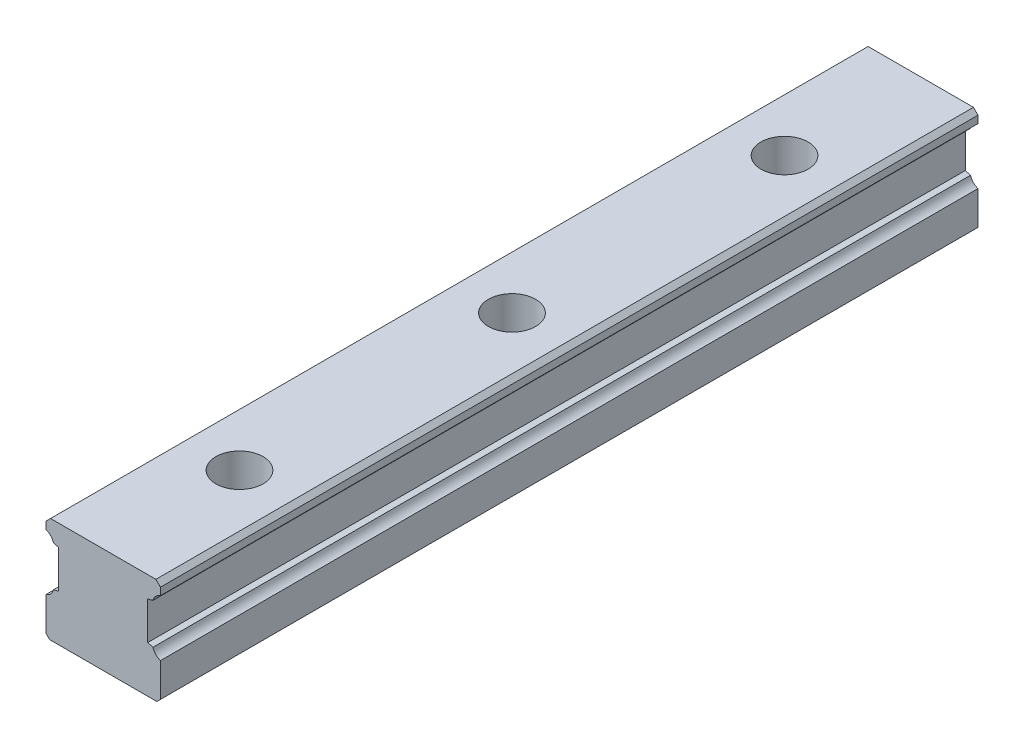
ISO-10303-21;
HEADER;
FILE_DESCRIPTION(('STEP AP214'),'2;1');
FILE_NAME('part.step','',(''),(''),'','','');
FILE_SCHEMA(('AUTOMOTIVE_DESIGN { 1 0 10303 214 1 1 1 1 }'));
ENDSEC;
DATA;
#1=APPLICATION_CONTEXT('core data for automotive mechanical design processes');
#2=APPLICATION_PROTOCOL_DEFINITION('international standard','automotive_design',2000,#1);
#3=PRODUCT_CONTEXT('',#1,'mechanical');
#4=PRODUCT('Part','Part','',(#3));
#5=PRODUCT_RELATED_PRODUCT_CATEGORY('part','',(#4));
#6=PRODUCT_DEFINITION_FORMATION('','',#4);
#7=PRODUCT_DEFINITION_CONTEXT('part definition',#1,'design');
#8=PRODUCT_DEFINITION('design','',#6,#7);
#9=PRODUCT_DEFINITION_SHAPE('','',#8);
#10=(LENGTH_UNIT() NAMED_UNIT(*) SI_UNIT(.MILLI.,.METRE.));
#11=(NAMED_UNIT(*) PLANE_ANGLE_UNIT() SI_UNIT($,.RADIAN.));
#12=(NAMED_UNIT(*) SI_UNIT($,.STERADIAN.) SOLID_ANGLE_UNIT());
#13=UNCERTAINTY_MEASURE_WITH_UNIT(LENGTH_MEASURE(1.E-05),#10,'distance_accuracy_value','');
#14=(GEOMETRIC_REPRESENTATION_CONTEXT(3) GLOBAL_UNCERTAINTY_ASSIGNED_CONTEXT((#13)) GLOBAL_UNIT_ASSIGNED_CONTEXT((#10,
#11,#12)) REPRESENTATION_CONTEXT('',''));
#15=CARTESIAN_POINT('',(0.,0.,0.));
#16=DIRECTION('',(0.,0.,1.));
#17=DIRECTION('',(1.,0.,0.));
#18=AXIS2_PLACEMENT_3D('',#15,#16,#17);
#19=CARTESIAN_POINT('',(-33.3777226859024,26.4266666882063,450.));
#20=DIRECTION('',(0.,0.,-1.));
#21=DIRECTION('',(-1.,0.,0.));
#22=AXIS2_PLACEMENT_3D('',#19,#20,#21);
#23=CYLINDRICAL_SURFACE('',#22,6.19099198633477);
#24=CARTESIAN_POINT('',(-33.3777226859024,26.4266666882063,0.));
#25=DIRECTION('',(0.,0.,-1.));
#26=DIRECTION('',(-1.,0.,0.));
#27=AXIS2_PLACEMENT_3D('',#24,#25,#26);
#28=CIRCLE('',#27,6.19099198633477);
#29=CARTESIAN_POINT('',(-27.3979395737064,24.823365186318,0.));
#30=VERTEX_POINT('',#29);
#31=CARTESIAN_POINT('',(-31.5,20.5272989856717,0.));
#32=VERTEX_POINT('',#31);
#33=EDGE_CURVE('E190',#30,#32,#28,.T.);
#34=ORIENTED_EDGE('',*,*,#33,.T.);
#35=DIRECTION('',(0.,0.,-1.));
#36=VECTOR('',#35,1.);
#37=CARTESIAN_POINT('',(-31.5,20.5272989856717,450.));
#38=LINE('',#37,#36);
#39=CARTESIAN_POINT('',(-31.5,20.5272989856717,450.));
#40=VERTEX_POINT('',#39);
#41=EDGE_CURVE('E173',#40,#32,#38,.T.);
#42=ORIENTED_EDGE('',*,*,#41,.F.);
#43=CARTESIAN_POINT('',(-33.3777226859024,26.4266666882063,450.));
#44=DIRECTION('',(0.,0.,-1.));
#45=DIRECTION('',(-1.,0.,0.));
#46=AXIS2_PLACEMENT_3D('',#43,#44,#45);
#47=CIRCLE('',#46,6.19099198633477);
#48=CARTESIAN_POINT('',(-27.3979395737064,24.823365186318,450.));
#49=VERTEX_POINT('',#48);
#50=EDGE_CURVE('E178',#49,#40,#47,.T.);
#51=ORIENTED_EDGE('',*,*,#50,.F.);
#52=DIRECTION('',(0.,0.,-1.));
#53=VECTOR('',#52,1.);
#54=CARTESIAN_POINT('',(-27.3979395737064,24.823365186318,450.));
#55=LINE('',#54,#53);
#56=EDGE_CURVE('E281',#49,#30,#55,.T.);
#57=ORIENTED_EDGE('',*,*,#56,.T.);
#58=EDGE_LOOP('',(#34,#42,#51,#57));
#59=FACE_BOUND('',#58,.T.);
#60=ADVANCED_FACE('F33',(#59),#23,.F.);
#61=CARTESIAN_POINT('',(-31.5,20.5272989856717,450.));
#62=DIRECTION('',(1.,0.,0.));
#63=DIRECTION('',(0.,1.,0.));
#64=AXIS2_PLACEMENT_3D('',#61,#62,#63);
#65=PLANE('',#64);
#66=DIRECTION('',(0.,-1.,0.));
#67=VECTOR('',#66,1.);
#68=CARTESIAN_POINT('',(-31.5,20.5272989856717,0.));
#69=LINE('',#68,#67);
#70=CARTESIAN_POINT('',(-31.5,2.,0.));
#71=VERTEX_POINT('',#70);
#72=EDGE_CURVE('E251',#32,#71,#69,.T.);
#73=ORIENTED_EDGE('',*,*,#72,.T.);
#74=DIRECTION('',(0.,0.,1.));
#75=VECTOR('',#74,1.);
#76=CARTESIAN_POINT('',(-31.5,2.,450.));
#77=LINE('',#76,#75);
#78=CARTESIAN_POINT('',(-31.5,2.,450.));
#79=VERTEX_POINT('',#78);
#80=EDGE_CURVE('E11',#71,#79,#77,.T.);
#81=ORIENTED_EDGE('',*,*,#80,.T.);
#82=DIRECTION('',(0.,-1.,0.));
#83=VECTOR('',#82,1.);
#84=CARTESIAN_POINT('',(-31.5,20.5272989856717,450.));
#85=LINE('',#84,#83);
#86=EDGE_CURVE('E169',#40,#79,#85,.T.);
#87=ORIENTED_EDGE('',*,*,#86,.F.);
#88=ORIENTED_EDGE('',*,*,#41,.T.);
#89=EDGE_LOOP('',(#73,#81,#87,#88));
#90=FACE_BOUND('',#89,.T.);
#91=ADVANCED_FACE('F171',(#90),#65,.F.);
#92=CARTESIAN_POINT('',(-31.5,0.,450.));
#93=DIRECTION('',(0.,1.,0.));
#94=DIRECTION('',(0.,0.,1.));
#95=AXIS2_PLACEMENT_3D('',#92,#93,#94);
#96=PLANE('',#95);
#97=CARTESIAN_POINT('',(0.,0.,75.0000000000002));
#98=DIRECTION('',(0.,1.,0.));
#99=DIRECTION('',(0.,0.,1.));
#100=AXIS2_PLACEMENT_3D('',#97,#98,#99);
#101=CIRCLE('',#100,9.);
#102=CARTESIAN_POINT('',(0.,0.,84.0000000000002));
#103=VERTEX_POINT('',#102);
#104=EDGE_CURVE('E675',#103,#103,#101,.T.);
#105=ORIENTED_EDGE('',*,*,#104,.T.);
#106=EDGE_LOOP('',(#105));
#107=FACE_BOUND('',#106,.T.);
#108=CARTESIAN_POINT('',(0.,0.,375.));
#109=DIRECTION('',(0.,1.,0.));
#110=DIRECTION('',(0.,0.,1.));
#111=AXIS2_PLACEMENT_3D('',#108,#109,#110);
#112=CIRCLE('',#111,9.);
#113=CARTESIAN_POINT('',(0.,0.,384.));
#114=VERTEX_POINT('',#113);
#115=EDGE_CURVE('E678',#114,#114,#112,.T.);
#116=ORIENTED_EDGE('',*,*,#115,.T.);
#117=EDGE_LOOP('',(#116));
#118=FACE_BOUND('',#117,.T.);
#119=CARTESIAN_POINT('',(0.,0.,225.));
#120=DIRECTION('',(0.,1.,0.));
#121=DIRECTION('',(0.,0.,1.));
#122=AXIS2_PLACEMENT_3D('',#119,#120,#121);
#123=CIRCLE('',#122,9.);
#124=CARTESIAN_POINT('',(0.,0.,234.));
#125=VERTEX_POINT('',#124);
#126=EDGE_CURVE('E348',#125,#125,#123,.T.);
#127=ORIENTED_EDGE('',*,*,#126,.T.);
#128=EDGE_LOOP('',(#127));
#129=FACE_BOUND('',#128,.T.);
#130=DIRECTION('',(1.,0.,0.));
#131=VECTOR('',#130,1.);
#132=CARTESIAN_POINT('',(-31.5,0.,0.));
#133=LINE('',#132,#131);
#134=CARTESIAN_POINT('',(-29.5,0.,0.));
#135=VERTEX_POINT('',#134);
#136=CARTESIAN_POINT('',(29.4999999999999,0.,0.));
#137=VERTEX_POINT('',#136);
#138=EDGE_CURVE('E246',#135,#137,#133,.T.);
#139=ORIENTED_EDGE('',*,*,#138,.T.);
#140=DIRECTION('',(0.,0.,1.));
#141=VECTOR('',#140,1.);
#142=CARTESIAN_POINT('',(29.4999999999999,0.,450.));
#143=LINE('',#142,#141);
#144=CARTESIAN_POINT('',(29.4999999999999,0.,450.));
#145=VERTEX_POINT('',#144);
#146=EDGE_CURVE('E54',#137,#145,#143,.T.);
#147=ORIENTED_EDGE('',*,*,#146,.T.);
#148=DIRECTION('',(1.,0.,0.));
#149=VECTOR('',#148,1.);
#150=CARTESIAN_POINT('',(-31.5,0.,450.));
#151=LINE('',#150,#149);
#152=CARTESIAN_POINT('',(-29.5,0.,450.));
#153=VERTEX_POINT('',#152);
#154=EDGE_CURVE('E177',#153,#145,#151,.T.);
#155=ORIENTED_EDGE('',*,*,#154,.F.);
#156=DIRECTION('',(0.,0.,-1.));
#157=VECTOR('',#156,1.);
#158=CARTESIAN_POINT('',(-29.5,0.,450.));
#159=LINE('',#158,#157);
#160=EDGE_CURVE('E225',#153,#135,#159,.T.);
#161=ORIENTED_EDGE('',*,*,#160,.T.);
#162=EDGE_LOOP('',(#139,#147,#155,#161));
#163=FACE_BOUND('',#162,.T.);
#164=ADVANCED_FACE('F249',(#107,#118,#129,#163),#96,.F.);
#165=CARTESIAN_POINT('',(31.5,0.,450.));
#166=DIRECTION('',(-1.,0.,0.));
#167=DIRECTION('',(0.,-1.,0.));
#168=AXIS2_PLACEMENT_3D('',#165,#166,#167);
#169=PLANE('',#168);
#170=DIRECTION('',(0.,1.,0.));
#171=VECTOR('',#170,1.);
#172=CARTESIAN_POINT('',(31.5,0.,450.));
#173=LINE('',#172,#171);
#174=CARTESIAN_POINT('',(31.5,2.00000000000006,450.));
#175=VERTEX_POINT('',#174);
#176=CARTESIAN_POINT('',(31.5,20.5272989856717,450.));
#177=VERTEX_POINT('',#176);
#178=EDGE_CURVE('E232',#175,#177,#173,.T.);
#179=ORIENTED_EDGE('',*,*,#178,.F.);
#180=DIRECTION('',(0.,0.,-1.));
#181=VECTOR('',#180,1.);
#182=CARTESIAN_POINT('',(31.5,2.00000000000006,450.));
#183=LINE('',#182,#181);
#184=CARTESIAN_POINT('',(31.5,2.00000000000008,0.));
#185=VERTEX_POINT('',#184);
#186=EDGE_CURVE('E218',#175,#185,#183,.T.);
#187=ORIENTED_EDGE('',*,*,#186,.T.);
#188=DIRECTION('',(0.,1.,0.));
#189=VECTOR('',#188,1.);
#190=CARTESIAN_POINT('',(31.5,0.,0.));
#191=LINE('',#190,#189);
#192=CARTESIAN_POINT('',(31.5,20.5272989856717,0.));
#193=VERTEX_POINT('',#192);
#194=EDGE_CURVE('E248',#185,#193,#191,.T.);
#195=ORIENTED_EDGE('',*,*,#194,.T.);
#196=DIRECTION('',(0.,0.,-1.));
#197=VECTOR('',#196,1.);
#198=CARTESIAN_POINT('',(31.5,20.5272989856717,450.));
#199=LINE('',#198,#197);
#200=EDGE_CURVE('E192',#177,#193,#199,.T.);
#201=ORIENTED_EDGE('',*,*,#200,.F.);
#202=EDGE_LOOP('',(#179,#187,#195,#201));
#203=FACE_BOUND('',#202,.T.);
#204=ADVANCED_FACE('F237',(#203),#169,.F.);
#205=CARTESIAN_POINT('',(33.3764580383009,26.4270690663916,450.));
#206=DIRECTION('',(0.,0.,-1.));
#207=DIRECTION('',(-1.,0.,0.));
#208=AXIS2_PLACEMENT_3D('',#205,#206,#207);
#209=CYLINDRICAL_SURFACE('',#208,6.19099198633479);
#210=CARTESIAN_POINT('',(33.3764580383009,26.4270690663916,0.));
#211=DIRECTION('',(0.,0.,-1.));
#212=DIRECTION('',(-1.,0.,0.));
#213=AXIS2_PLACEMENT_3D('',#210,#211,#212);
#214=CIRCLE('',#213,6.19099198633479);
#215=CARTESIAN_POINT('',(27.3972660609101,24.8215644502767,0.));
#216=VERTEX_POINT('',#215);
#217=EDGE_CURVE('E253',#193,#216,#214,.T.);
#218=ORIENTED_EDGE('',*,*,#217,.T.);
#219=DIRECTION('',(0.,0.,-1.));
#220=VECTOR('',#219,1.);
#221=CARTESIAN_POINT('',(27.3972660609101,24.8215644502767,450.));
#222=LINE('',#221,#220);
#223=CARTESIAN_POINT('',(27.3972660609101,24.8215644502767,450.));
#224=VERTEX_POINT('',#223);
#225=EDGE_CURVE('E198',#224,#216,#222,.T.);
#226=ORIENTED_EDGE('',*,*,#225,.F.);
#227=CARTESIAN_POINT('',(33.3764580383009,26.4270690663916,450.));
#228=DIRECTION('',(0.,0.,-1.));
#229=DIRECTION('',(-1.,0.,0.));
#230=AXIS2_PLACEMENT_3D('',#227,#228,#229);
#231=CIRCLE('',#230,6.19099198633479);
#232=EDGE_CURVE('E240',#177,#224,#231,.T.);
#233=ORIENTED_EDGE('',*,*,#232,.F.);
#234=ORIENTED_EDGE('',*,*,#200,.T.);
#235=EDGE_LOOP('',(#218,#226,#233,#234));
#236=FACE_BOUND('',#235,.T.);
#237=ADVANCED_FACE('F360',(#236),#209,.F.);
#238=CARTESIAN_POINT('',(27.3972660609101,24.8215644502767,450.));
#239=DIRECTION('',(-0.258818484515107,-0.965925976497839,0.));
#240=DIRECTION('',(0.965925976497839,-0.258818484515107,0.));
#241=AXIS2_PLACEMENT_3D('',#238,#239,#240);
#242=PLANE('',#241);
#243=DIRECTION('',(-0.965925976497839,0.258818484515107,0.));
#244=VECTOR('',#243,1.);
#245=CARTESIAN_POINT('',(27.3972660609101,24.8215644502767,0.));
#246=LINE('',#245,#244);
#247=CARTESIAN_POINT('',(24.5,25.5978827493668,0.));
#248=VERTEX_POINT('',#247);
#249=EDGE_CURVE('E259',#216,#248,#246,.T.);
#250=ORIENTED_EDGE('',*,*,#249,.T.);
#251=DIRECTION('',(0.,0.,-1.));
#252=VECTOR('',#251,1.);
#253=CARTESIAN_POINT('',(24.5,25.5978827493668,450.));
#254=LINE('',#253,#252);
#255=CARTESIAN_POINT('',(24.5,25.5978827493668,450.));
#256=VERTEX_POINT('',#255);
#257=EDGE_CURVE('E304',#256,#248,#254,.T.);
#258=ORIENTED_EDGE('',*,*,#257,.F.);
#259=DIRECTION('',(-0.965925976497839,0.258818484515107,0.));
#260=VECTOR('',#259,1.);
#261=CARTESIAN_POINT('',(27.3972660609101,24.8215644502767,450.));
#262=LINE('',#261,#260);
#263=EDGE_CURVE('E313',#224,#256,#262,.T.);
#264=ORIENTED_EDGE('',*,*,#263,.F.);
#265=ORIENTED_EDGE('',*,*,#225,.T.);
#266=EDGE_LOOP('',(#250,#258,#264,#265));
#267=FACE_BOUND('',#266,.T.);
#268=ADVANCED_FACE('F311',(#267),#242,.F.);
#269=CARTESIAN_POINT('',(24.5,25.5978827493668,450.));
#270=DIRECTION('',(-1.,0.,0.));
#271=DIRECTION('',(0.,0.,1.));
#272=AXIS2_PLACEMENT_3D('',#269,#270,#271);
#273=PLANE('',#272);
#274=DIRECTION('',(0.,1.,0.));
#275=VECTOR('',#274,1.);
#276=CARTESIAN_POINT('',(24.5,25.5978827493668,0.));
#277=LINE('',#276,#275);
#278=CARTESIAN_POINT('',(24.5,46.3976861971019,0.));
#279=VERTEX_POINT('',#278);
#280=EDGE_CURVE('E261',#248,#279,#277,.T.);
#281=ORIENTED_EDGE('',*,*,#280,.T.);
#282=DIRECTION('',(0.,0.,-1.));
#283=VECTOR('',#282,1.);
#284=CARTESIAN_POINT('',(24.5,46.3976861971019,450.));
#285=LINE('',#284,#283);
#286=CARTESIAN_POINT('',(24.5,46.3976861971019,450.));
#287=VERTEX_POINT('',#286);
#288=EDGE_CURVE('E301',#287,#279,#285,.T.);
#289=ORIENTED_EDGE('',*,*,#288,.F.);
#290=DIRECTION('',(0.,1.,0.));
#291=VECTOR('',#290,1.);
#292=CARTESIAN_POINT('',(24.5,25.5978827493668,450.));
#293=LINE('',#292,#291);
#294=EDGE_CURVE('E329',#256,#287,#293,.T.);
#295=ORIENTED_EDGE('',*,*,#294,.F.);
#296=ORIENTED_EDGE('',*,*,#257,.T.);
#297=EDGE_LOOP('',(#281,#289,#295,#296));
#298=FACE_BOUND('',#297,.T.);
#299=ADVANCED_FACE('F320',(#298),#273,.F.);
#300=CARTESIAN_POINT('',(24.5,46.3976861971019,450.));
#301=DIRECTION('',(-0.258791712283628,0.965933149681337,0.));
#302=DIRECTION('',(-0.965933149681337,-0.258791712283628,0.));
#303=AXIS2_PLACEMENT_3D('',#300,#301,#302);
#304=PLANE('',#303);
#305=DIRECTION('',(0.965933149681337,0.258791712283628,0.));
#306=VECTOR('',#305,1.);
#307=CARTESIAN_POINT('',(24.5,46.3976861971019,0.));
#308=LINE('',#307,#306);
#309=CARTESIAN_POINT('',(27.3971197121364,47.1738792196125,0.));
#310=VERTEX_POINT('',#309);
#311=EDGE_CURVE('E263',#279,#310,#308,.T.);
#312=ORIENTED_EDGE('',*,*,#311,.T.);
#313=DIRECTION('',(0.,0.,-1.));
#314=VECTOR('',#313,1.);
#315=CARTESIAN_POINT('',(27.3971197121364,47.1738792196125,450.));
#316=LINE('',#315,#314);
#317=CARTESIAN_POINT('',(27.3971197121364,47.1738792196125,450.));
#318=VERTEX_POINT('',#317);
#319=EDGE_CURVE('E298',#318,#310,#316,.T.);
#320=ORIENTED_EDGE('',*,*,#319,.F.);
#321=DIRECTION('',(0.965933149681337,0.258791712283628,0.));
#322=VECTOR('',#321,1.);
#323=CARTESIAN_POINT('',(24.5,46.3976861971019,450.));
#324=LINE('',#323,#322);
#325=EDGE_CURVE('E326',#287,#318,#324,.T.);
#326=ORIENTED_EDGE('',*,*,#325,.F.);
#327=ORIENTED_EDGE('',*,*,#288,.T.);
#328=EDGE_LOOP('',(#312,#320,#326,#327));
#329=FACE_BOUND('',#328,.T.);
#330=ADVANCED_FACE('F324',(#329),#304,.F.);
#331=CARTESIAN_POINT('',(33.3782102064319,45.5757339298287,450.));
#332=DIRECTION('',(0.,0.,-1.));
#333=DIRECTION('',(-1.,0.,0.));
#334=AXIS2_PLACEMENT_3D('',#331,#332,#333);
#335=CYLINDRICAL_SURFACE('',#334,6.19092173009895);
#336=CARTESIAN_POINT('',(33.3782102064319,45.5757339298287,0.));
#337=DIRECTION('',(0.,0.,-1.));
#338=DIRECTION('',(-1.,0.,0.));
#339=AXIS2_PLACEMENT_3D('',#336,#337,#338);
#340=CIRCLE('',#339,6.19092173009895);
#341=CARTESIAN_POINT('',(31.5,51.4748727049946,0.));
#342=VERTEX_POINT('',#341);
#343=EDGE_CURVE('E265',#310,#342,#340,.T.);
#344=ORIENTED_EDGE('',*,*,#343,.T.);
#345=DIRECTION('',(0.,0.,-1.));
#346=VECTOR('',#345,1.);
#347=CARTESIAN_POINT('',(31.5,51.4748727049946,450.));
#348=LINE('',#347,#346);
#349=CARTESIAN_POINT('',(31.5,51.4748727049946,450.));
#350=VERTEX_POINT('',#349);
#351=EDGE_CURVE('E295',#350,#342,#348,.T.);
#352=ORIENTED_EDGE('',*,*,#351,.F.);
#353=CARTESIAN_POINT('',(33.3782102064319,45.5757339298287,450.));
#354=DIRECTION('',(0.,0.,-1.));
#355=DIRECTION('',(-1.,0.,0.));
#356=AXIS2_PLACEMENT_3D('',#353,#354,#355);
#357=CIRCLE('',#356,6.19092173009895);
#358=EDGE_CURVE('E328',#318,#350,#357,.T.);
#359=ORIENTED_EDGE('',*,*,#358,.F.);
#360=ORIENTED_EDGE('',*,*,#319,.T.);
#361=EDGE_LOOP('',(#344,#352,#359,#360));
#362=FACE_BOUND('',#361,.T.);
#363=ADVANCED_FACE('F431',(#362),#335,.F.);
#364=CARTESIAN_POINT('',(31.5,51.4748727049946,450.));
#365=DIRECTION('',(-1.,0.,0.));
#366=DIRECTION('',(0.,0.,1.));
#367=AXIS2_PLACEMENT_3D('',#364,#365,#366);
#368=PLANE('',#367);
#369=DIRECTION('',(0.,1.,0.));
#370=VECTOR('',#369,1.);
#371=CARTESIAN_POINT('',(31.5,51.4748727049946,0.));
#372=LINE('',#371,#370);
#373=CARTESIAN_POINT('',(31.5,55.4997125453559,0.));
#374=VERTEX_POINT('',#373);
#375=EDGE_CURVE('E267',#342,#374,#372,.T.);
#376=ORIENTED_EDGE('',*,*,#375,.T.);
#377=DIRECTION('',(0.,0.,1.));
#378=VECTOR('',#377,1.);
#379=CARTESIAN_POINT('',(31.5,55.4997125453559,450.));
#380=LINE('',#379,#378);
#381=CARTESIAN_POINT('',(31.5,55.4997125453559,450.));
#382=VERTEX_POINT('',#381);
#383=EDGE_CURVE('E214',#374,#382,#380,.T.);
#384=ORIENTED_EDGE('',*,*,#383,.T.);
#385=DIRECTION('',(0.,1.,0.));
#386=VECTOR('',#385,1.);
#387=CARTESIAN_POINT('',(31.5,51.4748727049946,450.));
#388=LINE('',#387,#386);
#389=EDGE_CURVE('E331',#350,#382,#388,.T.);
#390=ORIENTED_EDGE('',*,*,#389,.F.);
#391=ORIENTED_EDGE('',*,*,#351,.T.);
#392=EDGE_LOOP('',(#376,#384,#390,#391));
#393=FACE_BOUND('',#392,.T.);
#394=ADVANCED_FACE('F428',(#393),#368,.F.);
#395=CARTESIAN_POINT('',(31.5,58.,450.));
#396=DIRECTION('',(0.,-1.,0.));
#397=DIRECTION('',(1.,0.,0.));
#398=AXIS2_PLACEMENT_3D('',#395,#396,#397);
#399=PLANE('',#398);
#400=CARTESIAN_POINT('',(0.,58.,75.0000000000002));
#401=DIRECTION('',(0.,1.,0.));
#402=DIRECTION('',(0.,0.,1.));
#403=AXIS2_PLACEMENT_3D('',#400,#401,#402);
#404=CIRCLE('',#403,13.);
#405=CARTESIAN_POINT('',(0.,58.,88.0000000000002));
#406=VERTEX_POINT('',#405);
#407=EDGE_CURVE('E706',#406,#406,#404,.T.);
#408=ORIENTED_EDGE('',*,*,#407,.F.);
#409=EDGE_LOOP('',(#408));
#410=FACE_BOUND('',#409,.T.);
#411=CARTESIAN_POINT('',(0.,58.,375.));
#412=DIRECTION('',(0.,1.,0.));
#413=DIRECTION('',(0.,0.,1.));
#414=AXIS2_PLACEMENT_3D('',#411,#412,#413);
#415=CIRCLE('',#414,13.);
#416=CARTESIAN_POINT('',(0.,58.,388.));
#417=VERTEX_POINT('',#416);
#418=EDGE_CURVE('E696',#417,#417,#415,.T.);
#419=ORIENTED_EDGE('',*,*,#418,.F.);
#420=EDGE_LOOP('',(#419));
#421=FACE_BOUND('',#420,.T.);
#422=CARTESIAN_POINT('',(0.,58.,225.));
#423=DIRECTION('',(0.,1.,0.));
#424=DIRECTION('',(0.,0.,1.));
#425=AXIS2_PLACEMENT_3D('',#422,#423,#424);
#426=CIRCLE('',#425,13.);
#427=CARTESIAN_POINT('',(0.,58.,238.));
#428=VERTEX_POINT('',#427);
#429=EDGE_CURVE('E679',#428,#428,#426,.T.);
#430=ORIENTED_EDGE('',*,*,#429,.F.);
#431=EDGE_LOOP('',(#430));
#432=FACE_BOUND('',#431,.T.);
#433=DIRECTION('',(-1.,0.,0.));
#434=VECTOR('',#433,1.);
#435=CARTESIAN_POINT('',(31.5,58.,450.));
#436=LINE('',#435,#434);
#437=CARTESIAN_POINT('',(28.9995762209439,58.,450.));
#438=VERTEX_POINT('',#437);
#439=CARTESIAN_POINT('',(-28.9997427549509,58.,450.));
#440=VERTEX_POINT('',#439);
#441=EDGE_CURVE('E338',#438,#440,#436,.T.);
#442=ORIENTED_EDGE('',*,*,#441,.F.);
#443=DIRECTION('',(0.,0.,-1.));
#444=VECTOR('',#443,1.);
#445=CARTESIAN_POINT('',(28.9995762209439,58.,450.));
#446=LINE('',#445,#444);
#447=CARTESIAN_POINT('',(28.9995762209439,58.,0.));
#448=VERTEX_POINT('',#447);
#449=EDGE_CURVE('E209',#438,#448,#446,.T.);
#450=ORIENTED_EDGE('',*,*,#449,.T.);
#451=DIRECTION('',(-1.,0.,0.));
#452=VECTOR('',#451,1.);
#453=CARTESIAN_POINT('',(31.5,58.,0.));
#454=LINE('',#453,#452);
#455=CARTESIAN_POINT('',(-28.9997427549509,58.,0.));
#456=VERTEX_POINT('',#455);
#457=EDGE_CURVE('E270',#448,#456,#454,.T.);
#458=ORIENTED_EDGE('',*,*,#457,.T.);
#459=DIRECTION('',(0.,0.,1.));
#460=VECTOR('',#459,1.);
#461=CARTESIAN_POINT('',(-28.9997427549509,58.,450.));
#462=LINE('',#461,#460);
#463=EDGE_CURVE('E204',#456,#440,#462,.T.);
#464=ORIENTED_EDGE('',*,*,#463,.T.);
#465=EDGE_LOOP('',(#442,#450,#458,#464));
#466=FACE_BOUND('',#465,.T.);
#467=ADVANCED_FACE('F422',(#410,#421,#432,#466),#399,.F.);
#468=CARTESIAN_POINT('',(-31.5,58.,450.));
#469=DIRECTION('',(1.,0.,0.));
#470=DIRECTION('',(0.,0.,-1.));
#471=AXIS2_PLACEMENT_3D('',#468,#469,#470);
#472=PLANE('',#471);
#473=DIRECTION('',(0.,-1.,0.));
#474=VECTOR('',#473,1.);
#475=CARTESIAN_POINT('',(-31.5,58.,450.));
#476=LINE('',#475,#474);
#477=CARTESIAN_POINT('',(-31.5,55.4997125453558,450.));
#478=VERTEX_POINT('',#477);
#479=CARTESIAN_POINT('',(-31.5,51.4748727049946,450.));
#480=VERTEX_POINT('',#479);
#481=EDGE_CURVE('E340',#478,#480,#476,.T.);
#482=ORIENTED_EDGE('',*,*,#481,.F.);
#483=DIRECTION('',(0.,0.,-1.));
#484=VECTOR('',#483,1.);
#485=CARTESIAN_POINT('',(-31.5,55.4997125453558,450.));
#486=LINE('',#485,#484);
#487=CARTESIAN_POINT('',(-31.5,55.4997125453558,0.));
#488=VERTEX_POINT('',#487);
#489=EDGE_CURVE('E191',#478,#488,#486,.T.);
#490=ORIENTED_EDGE('',*,*,#489,.T.);
#491=DIRECTION('',(0.,-1.,0.));
#492=VECTOR('',#491,1.);
#493=CARTESIAN_POINT('',(-31.5,58.,0.));
#494=LINE('',#493,#492);
#495=CARTESIAN_POINT('',(-31.5,51.4748727049946,0.));
#496=VERTEX_POINT('',#495);
#497=EDGE_CURVE('E272',#488,#496,#494,.T.);
#498=ORIENTED_EDGE('',*,*,#497,.T.);
#499=DIRECTION('',(0.,0.,-1.));
#500=VECTOR('',#499,1.);
#501=CARTESIAN_POINT('',(-31.5,51.4748727049946,450.));
#502=LINE('',#501,#500);
#503=EDGE_CURVE('E292',#480,#496,#502,.T.);
#504=ORIENTED_EDGE('',*,*,#503,.F.);
#505=EDGE_LOOP('',(#482,#490,#498,#504));
#506=FACE_BOUND('',#505,.T.);
#507=ADVANCED_FACE('F414',(#506),#472,.F.);
#508=CARTESIAN_POINT('',(-33.3784417707757,45.5757339298287,450.));
#509=DIRECTION('',(0.,0.,-1.));
#510=DIRECTION('',(-1.,0.,0.));
#511=AXIS2_PLACEMENT_3D('',#508,#509,#510);
#512=CYLINDRICAL_SURFACE('',#511,6.19099198633477);
#513=CARTESIAN_POINT('',(-33.3784417707757,45.5757339298287,0.));
#514=DIRECTION('',(0.,0.,-1.));
#515=DIRECTION('',(-1.,0.,0.));
#516=AXIS2_PLACEMENT_3D('',#513,#514,#515);
#517=CIRCLE('',#516,6.19099198633477);
#518=CARTESIAN_POINT('',(-27.3978021352707,47.1758374655687,0.));
#519=VERTEX_POINT('',#518);
#520=EDGE_CURVE('E274',#496,#519,#517,.T.);
#521=ORIENTED_EDGE('',*,*,#520,.T.);
#522=DIRECTION('',(0.,0.,-1.));
#523=VECTOR('',#522,1.);
#524=CARTESIAN_POINT('',(-27.3978021352707,47.1758374655687,450.));
#525=LINE('',#524,#523);
#526=CARTESIAN_POINT('',(-27.3978021352707,47.1758374655687,450.));
#527=VERTEX_POINT('',#526);
#528=EDGE_CURVE('E289',#527,#519,#525,.T.);
#529=ORIENTED_EDGE('',*,*,#528,.F.);
#530=CARTESIAN_POINT('',(-33.3784417707757,45.5757339298287,450.));
#531=DIRECTION('',(0.,0.,-1.));
#532=DIRECTION('',(-1.,0.,0.));
#533=AXIS2_PLACEMENT_3D('',#530,#531,#532);
#534=CIRCLE('',#533,6.19099198633477);
#535=EDGE_CURVE('E342',#480,#527,#534,.T.);
#536=ORIENTED_EDGE('',*,*,#535,.F.);
#537=ORIENTED_EDGE('',*,*,#503,.T.);
#538=EDGE_LOOP('',(#521,#529,#536,#537));
#539=FACE_BOUND('',#538,.T.);
#540=ADVANCED_FACE('F409',(#539),#512,.F.);
#541=CARTESIAN_POINT('',(-27.3978021352707,47.1758374655687,450.));
#542=DIRECTION('',(0.258715586600086,0.965953541972994,0.));
#543=DIRECTION('',(-0.965953541972994,0.258715586600086,0.));
#544=AXIS2_PLACEMENT_3D('',#541,#542,#543);
#545=PLANE('',#544);
#546=DIRECTION('',(0.965953541972994,-0.258715586600087,0.));
#547=VECTOR('',#546,1.);
#548=CARTESIAN_POINT('',(-27.3978021352707,47.1758374655687,0.));
#549=LINE('',#548,#547);
#550=CARTESIAN_POINT('',(-24.5,46.3997063715761,0.));
#551=VERTEX_POINT('',#550);
#552=EDGE_CURVE('E276',#519,#551,#549,.T.);
#553=ORIENTED_EDGE('',*,*,#552,.T.);
#554=DIRECTION('',(0.,0.,-1.));
#555=VECTOR('',#554,1.);
#556=CARTESIAN_POINT('',(-24.5,46.3997063715761,450.));
#557=LINE('',#556,#555);
#558=CARTESIAN_POINT('',(-24.5,46.3997063715761,450.));
#559=VERTEX_POINT('',#558);
#560=EDGE_CURVE('E286',#559,#551,#557,.T.);
#561=ORIENTED_EDGE('',*,*,#560,.F.);
#562=DIRECTION('',(0.965953541972994,-0.258715586600087,0.));
#563=VECTOR('',#562,1.);
#564=CARTESIAN_POINT('',(-27.3978021352707,47.1758374655687,450.));
#565=LINE('',#564,#563);
#566=EDGE_CURVE('E344',#527,#559,#565,.T.);
#567=ORIENTED_EDGE('',*,*,#566,.F.);
#568=ORIENTED_EDGE('',*,*,#528,.T.);
#569=EDGE_LOOP('',(#553,#561,#567,#568));
#570=FACE_BOUND('',#569,.T.);
#571=ADVANCED_FACE('F404',(#570),#545,.F.);
#572=CARTESIAN_POINT('',(-24.5,46.3997063715761,450.));
#573=DIRECTION('',(1.,0.,0.));
#574=DIRECTION('',(0.,1.,0.));
#575=AXIS2_PLACEMENT_3D('',#572,#573,#574);
#576=PLANE('',#575);
#577=DIRECTION('',(0.,-1.,0.));
#578=VECTOR('',#577,1.);
#579=CARTESIAN_POINT('',(-24.5,46.3997063715761,0.));
#580=LINE('',#579,#578);
#581=CARTESIAN_POINT('',(-24.5,25.5969732365157,0.));
#582=VERTEX_POINT('',#581);
#583=EDGE_CURVE('E278',#551,#582,#580,.T.);
#584=ORIENTED_EDGE('',*,*,#583,.T.);
#585=DIRECTION('',(0.,0.,-1.));
#586=VECTOR('',#585,1.);
#587=CARTESIAN_POINT('',(-24.5,25.5969732365157,450.));
#588=LINE('',#587,#586);
#589=CARTESIAN_POINT('',(-24.5,25.5969732365157,450.));
#590=VERTEX_POINT('',#589);
#591=EDGE_CURVE('E283',#590,#582,#588,.T.);
#592=ORIENTED_EDGE('',*,*,#591,.F.);
#593=DIRECTION('',(0.,-1.,0.));
#594=VECTOR('',#593,1.);
#595=CARTESIAN_POINT('',(-24.5,46.3997063715761,450.));
#596=LINE('',#595,#594);
#597=EDGE_CURVE('E346',#559,#590,#596,.T.);
#598=ORIENTED_EDGE('',*,*,#597,.F.);
#599=ORIENTED_EDGE('',*,*,#560,.T.);
#600=EDGE_LOOP('',(#584,#592,#598,#599));
#601=FACE_BOUND('',#600,.T.);
#602=ADVANCED_FACE('F400',(#601),#576,.F.);
#603=CARTESIAN_POINT('',(-24.5,25.5969732365157,450.));
#604=DIRECTION('',(0.257919173568785,-0.966166496989828,0.));
#605=DIRECTION('',(0.966166496989828,0.257919173568785,0.));
#606=AXIS2_PLACEMENT_3D('',#603,#604,#605);
#607=PLANE('',#606);
#608=DIRECTION('',(-0.966166496989828,-0.257919173568785,0.));
#609=VECTOR('',#608,1.);
#610=CARTESIAN_POINT('',(-24.5,25.5969732365157,0.));
#611=LINE('',#610,#609);
#612=EDGE_CURVE('E187',#582,#30,#611,.T.);
#613=ORIENTED_EDGE('',*,*,#612,.T.);
#614=ORIENTED_EDGE('',*,*,#56,.F.);
#615=DIRECTION('',(-0.966166496989828,-0.257919173568785,0.));
#616=VECTOR('',#615,1.);
#617=CARTESIAN_POINT('',(-24.5,25.5969732365157,450.));
#618=LINE('',#617,#616);
#619=EDGE_CURVE('E183',#590,#49,#618,.T.);
#620=ORIENTED_EDGE('',*,*,#619,.F.);
#621=ORIENTED_EDGE('',*,*,#591,.T.);
#622=EDGE_LOOP('',(#613,#614,#620,#621));
#623=FACE_BOUND('',#622,.T.);
#624=ADVANCED_FACE('F396',(#623),#607,.F.);
#625=CARTESIAN_POINT('',(-33.3777226859024,26.4266666882063,450.));
#626=DIRECTION('',(0.,0.,-1.));
#627=DIRECTION('',(-1.,0.,0.));
#628=AXIS2_PLACEMENT_3D('',#625,#626,#627);
#629=PLANE('',#628);
#630=ORIENTED_EDGE('',*,*,#154,.T.);
#631=DIRECTION('',(-0.707106781186548,-0.707106781186548,0.));
#632=VECTOR('',#631,1.);
#633=CARTESIAN_POINT('',(31.5,2.00000000000006,450.));
#634=LINE('',#633,#632);
#635=EDGE_CURVE('E41',#145,#175,#634,.F.);
#636=ORIENTED_EDGE('',*,*,#635,.T.);
#637=ORIENTED_EDGE('',*,*,#178,.T.);
#638=ORIENTED_EDGE('',*,*,#232,.T.);
#639=ORIENTED_EDGE('',*,*,#263,.T.);
#640=ORIENTED_EDGE('',*,*,#294,.T.);
#641=ORIENTED_EDGE('',*,*,#325,.T.);
#642=ORIENTED_EDGE('',*,*,#358,.T.);
#643=ORIENTED_EDGE('',*,*,#389,.T.);
#644=DIRECTION('',(0.707126057365013,-0.707087504482587,0.));
#645=VECTOR('',#644,1.);
#646=CARTESIAN_POINT('',(28.9995762209439,58.,450.));
#647=LINE('',#646,#645);
#648=EDGE_CURVE('E216',#382,#438,#647,.F.);
#649=ORIENTED_EDGE('',*,*,#648,.T.);
#650=ORIENTED_EDGE('',*,*,#441,.T.);
#651=DIRECTION('',(0.707102509357105,0.707111052990183,0.));
#652=VECTOR('',#651,1.);
#653=CARTESIAN_POINT('',(-31.5,55.4997125453558,450.));
#654=LINE('',#653,#652);
#655=EDGE_CURVE('E207',#440,#478,#654,.F.);
#656=ORIENTED_EDGE('',*,*,#655,.T.);
#657=ORIENTED_EDGE('',*,*,#481,.T.);
#658=ORIENTED_EDGE('',*,*,#535,.T.);
#659=ORIENTED_EDGE('',*,*,#566,.T.);
#660=ORIENTED_EDGE('',*,*,#597,.T.);
#661=ORIENTED_EDGE('',*,*,#619,.T.);
#662=ORIENTED_EDGE('',*,*,#50,.T.);
#663=ORIENTED_EDGE('',*,*,#86,.T.);
#664=DIRECTION('',(-0.707106781186548,0.707106781186548,0.));
#665=VECTOR('',#664,1.);
#666=CARTESIAN_POINT('',(-29.5,0.,450.));
#667=LINE('',#666,#665);
#668=EDGE_CURVE('E229',#79,#153,#667,.F.);
#669=ORIENTED_EDGE('',*,*,#668,.T.);
#670=EDGE_LOOP('',(#630,#636,#637,#638,#639,#640,#641,#642,#643,#649,#650,#656,#657,#658,#659,
#660,#661,#662,#663,#669));
#671=FACE_BOUND('',#670,.T.);
#672=ADVANCED_FACE('F181',(#671),#629,.F.);
#673=CARTESIAN_POINT('',(-33.3777226859024,26.4266666882063,0.));
#674=DIRECTION('',(0.,0.,-1.));
#675=DIRECTION('',(-1.,0.,0.));
#676=AXIS2_PLACEMENT_3D('',#673,#674,#675);
#677=PLANE('',#676);
#678=ORIENTED_EDGE('',*,*,#194,.F.);
#679=DIRECTION('',(0.707106781186548,0.707106781186548,0.));
#680=VECTOR('',#679,1.);
#681=CARTESIAN_POINT('',(11.2744720011519,-18.225527998848,0.));
#682=LINE('',#681,#680);
#683=EDGE_CURVE('E223',#185,#137,#682,.F.);
#684=ORIENTED_EDGE('',*,*,#683,.T.);
#685=ORIENTED_EDGE('',*,*,#138,.F.);
#686=DIRECTION('',(0.707106781186548,-0.707106781186548,0.));
#687=VECTOR('',#686,1.);
#688=CARTESIAN_POINT('',(-44.6521946870544,15.1521946870544,0.));
#689=LINE('',#688,#687);
#690=EDGE_CURVE('E221',#135,#71,#689,.F.);
#691=ORIENTED_EDGE('',*,*,#690,.T.);
#692=ORIENTED_EDGE('',*,*,#72,.F.);
#693=ORIENTED_EDGE('',*,*,#33,.F.);
#694=ORIENTED_EDGE('',*,*,#612,.F.);
#695=ORIENTED_EDGE('',*,*,#583,.F.);
#696=ORIENTED_EDGE('',*,*,#552,.F.);
#697=ORIENTED_EDGE('',*,*,#520,.F.);
#698=ORIENTED_EDGE('',*,*,#497,.F.);
#699=DIRECTION('',(-0.707102509357105,-0.707111052990183,0.));
#700=VECTOR('',#699,1.);
#701=CARTESIAN_POINT('',(-46.9753729266522,40.0241526360436,0.));
#702=LINE('',#701,#700);
#703=EDGE_CURVE('E195',#488,#456,#702,.F.);
#704=ORIENTED_EDGE('',*,*,#703,.T.);
#705=ORIENTED_EDGE('',*,*,#457,.F.);
#706=DIRECTION('',(-0.707126057365013,0.707087504482587,0.));
#707=VECTOR('',#706,1.);
#708=CARTESIAN_POINT('',(13.5958929321218,73.4028434719541,0.));
#709=LINE('',#708,#707);
#710=EDGE_CURVE('E212',#448,#374,#709,.F.);
#711=ORIENTED_EDGE('',*,*,#710,.T.);
#712=ORIENTED_EDGE('',*,*,#375,.F.);
#713=ORIENTED_EDGE('',*,*,#343,.F.);
#714=ORIENTED_EDGE('',*,*,#311,.F.);
#715=ORIENTED_EDGE('',*,*,#280,.F.);
#716=ORIENTED_EDGE('',*,*,#249,.F.);
#717=ORIENTED_EDGE('',*,*,#217,.F.);
#718=EDGE_LOOP('',(#678,#684,#685,#691,#692,#693,#694,#695,#696,#697,#698,#704,#705,#711,#712,
#713,#714,#715,#716,#717));
#719=FACE_BOUND('',#718,.T.);
#720=ADVANCED_FACE('F245',(#719),#677,.T.);
#721=CARTESIAN_POINT('',(0.,58.,225.));
#722=DIRECTION('',(0.,1.,0.));
#723=DIRECTION('',(0.,0.,1.));
#724=AXIS2_PLACEMENT_3D('',#721,#722,#723);
#725=CYLINDRICAL_SURFACE('',#724,9.00000000000001);
#726=ORIENTED_EDGE('',*,*,#126,.F.);
#727=EDGE_LOOP('',(#726));
#728=FACE_BOUND('',#727,.T.);
#729=CARTESIAN_POINT('',(0.,33.,225.));
#730=DIRECTION('',(0.,1.,0.));
#731=DIRECTION('',(0.,0.,1.));
#732=AXIS2_PLACEMENT_3D('',#729,#730,#731);
#733=CIRCLE('',#732,9.00000000000001);
#734=CARTESIAN_POINT('',(0.,33.,234.));
#735=VERTEX_POINT('',#734);
#736=EDGE_CURVE('E350',#735,#735,#733,.T.);
#737=ORIENTED_EDGE('',*,*,#736,.T.);
#738=EDGE_LOOP('',(#737));
#739=FACE_BOUND('',#738,.T.);
#740=ADVANCED_FACE('F497',(#728,#739),#725,.F.);
#741=CARTESIAN_POINT('',(9.00000000000001,33.,225.));
#742=DIRECTION('',(0.,-1.,0.));
#743=DIRECTION('',(0.,0.,-1.));
#744=AXIS2_PLACEMENT_3D('',#741,#742,#743);
#745=PLANE('',#744);
#746=ORIENTED_EDGE('',*,*,#736,.F.);
#747=EDGE_LOOP('',(#746));
#748=FACE_BOUND('',#747,.T.);
#749=CARTESIAN_POINT('',(0.,33.,225.));
#750=DIRECTION('',(0.,1.,0.));
#751=DIRECTION('',(0.,0.,1.));
#752=AXIS2_PLACEMENT_3D('',#749,#750,#751);
#753=CIRCLE('',#752,13.);
#754=CARTESIAN_POINT('',(0.,33.,238.));
#755=VERTEX_POINT('',#754);
#756=EDGE_CURVE('E355',#755,#755,#753,.T.);
#757=ORIENTED_EDGE('',*,*,#756,.T.);
#758=EDGE_LOOP('',(#757));
#759=FACE_BOUND('',#758,.T.);
#760=ADVANCED_FACE('F502',(#748,#759),#745,.F.);
#761=CARTESIAN_POINT('',(0.,58.,225.));
#762=DIRECTION('',(0.,1.,0.));
#763=DIRECTION('',(0.,0.,1.));
#764=AXIS2_PLACEMENT_3D('',#761,#762,#763);
#765=CYLINDRICAL_SURFACE('',#764,13.);
#766=ORIENTED_EDGE('',*,*,#756,.F.);
#767=EDGE_LOOP('',(#766));
#768=FACE_BOUND('',#767,.T.);
#769=ORIENTED_EDGE('',*,*,#429,.T.);
#770=EDGE_LOOP('',(#769));
#771=FACE_BOUND('',#770,.T.);
#772=ADVANCED_FACE('F514',(#768,#771),#765,.F.);
#773=CARTESIAN_POINT('',(0.,58.,375.));
#774=DIRECTION('',(0.,1.,0.));
#775=DIRECTION('',(0.,0.,1.));
#776=AXIS2_PLACEMENT_3D('',#773,#774,#775);
#777=CYLINDRICAL_SURFACE('',#776,9.00000000000001);
#778=ORIENTED_EDGE('',*,*,#115,.F.);
#779=EDGE_LOOP('',(#778));
#780=FACE_BOUND('',#779,.T.);
#781=CARTESIAN_POINT('',(0.,33.,375.));
#782=DIRECTION('',(0.,1.,0.));
#783=DIRECTION('',(0.,0.,1.));
#784=AXIS2_PLACEMENT_3D('',#781,#782,#783);
#785=CIRCLE('',#784,9.00000000000001);
#786=CARTESIAN_POINT('',(0.,33.,384.));
#787=VERTEX_POINT('',#786);
#788=EDGE_CURVE('E680',#787,#787,#785,.T.);
#789=ORIENTED_EDGE('',*,*,#788,.T.);
#790=EDGE_LOOP('',(#789));
#791=FACE_BOUND('',#790,.T.);
#792=ADVANCED_FACE('F524',(#780,#791),#777,.F.);
#793=CARTESIAN_POINT('',(9.00000000000001,33.,375.));
#794=DIRECTION('',(0.,-1.,0.));
#795=DIRECTION('',(0.,0.,-1.));
#796=AXIS2_PLACEMENT_3D('',#793,#794,#795);
#797=PLANE('',#796);
#798=ORIENTED_EDGE('',*,*,#788,.F.);
#799=EDGE_LOOP('',(#798));
#800=FACE_BOUND('',#799,.T.);
#801=CARTESIAN_POINT('',(0.,33.,375.));
#802=DIRECTION('',(0.,1.,0.));
#803=DIRECTION('',(0.,0.,1.));
#804=AXIS2_PLACEMENT_3D('',#801,#802,#803);
#805=CIRCLE('',#804,13.);
#806=CARTESIAN_POINT('',(0.,33.,388.));
#807=VERTEX_POINT('',#806);
#808=EDGE_CURVE('E685',#807,#807,#805,.T.);
#809=ORIENTED_EDGE('',*,*,#808,.T.);
#810=EDGE_LOOP('',(#809));
#811=FACE_BOUND('',#810,.T.);
#812=ADVANCED_FACE('F534',(#800,#811),#797,.F.);
#813=CARTESIAN_POINT('',(0.,58.,375.));
#814=DIRECTION('',(0.,1.,0.));
#815=DIRECTION('',(0.,0.,1.));
#816=AXIS2_PLACEMENT_3D('',#813,#814,#815);
#817=CYLINDRICAL_SURFACE('',#816,13.);
#818=ORIENTED_EDGE('',*,*,#808,.F.);
#819=EDGE_LOOP('',(#818));
#820=FACE_BOUND('',#819,.T.);
#821=ORIENTED_EDGE('',*,*,#418,.T.);
#822=EDGE_LOOP('',(#821));
#823=FACE_BOUND('',#822,.T.);
#824=ADVANCED_FACE('F544',(#820,#823),#817,.F.);
#825=CARTESIAN_POINT('',(0.,58.,75.0000000000002));
#826=DIRECTION('',(0.,1.,0.));
#827=DIRECTION('',(0.,0.,1.));
#828=AXIS2_PLACEMENT_3D('',#825,#826,#827);
#829=CYLINDRICAL_SURFACE('',#828,9.00000000000001);
#830=ORIENTED_EDGE('',*,*,#104,.F.);
#831=EDGE_LOOP('',(#830));
#832=FACE_BOUND('',#831,.T.);
#833=CARTESIAN_POINT('',(0.,33.,75.0000000000002));
#834=DIRECTION('',(0.,1.,0.));
#835=DIRECTION('',(0.,0.,1.));
#836=AXIS2_PLACEMENT_3D('',#833,#834,#835);
#837=CIRCLE('',#836,9.00000000000001);
#838=CARTESIAN_POINT('',(0.,33.,84.0000000000002));
#839=VERTEX_POINT('',#838);
#840=EDGE_CURVE('E700',#839,#839,#837,.T.);
#841=ORIENTED_EDGE('',*,*,#840,.T.);
#842=EDGE_LOOP('',(#841));
#843=FACE_BOUND('',#842,.T.);
#844=ADVANCED_FACE('F554',(#832,#843),#829,.F.);
#845=CARTESIAN_POINT('',(9.00000000000001,33.,75.0000000000002));
#846=DIRECTION('',(0.,-1.,0.));
#847=DIRECTION('',(0.,0.,-1.));
#848=AXIS2_PLACEMENT_3D('',#845,#846,#847);
#849=PLANE('',#848);
#850=ORIENTED_EDGE('',*,*,#840,.F.);
#851=EDGE_LOOP('',(#850));
#852=FACE_BOUND('',#851,.T.);
#853=CARTESIAN_POINT('',(0.,33.,75.0000000000002));
#854=DIRECTION('',(0.,1.,0.));
#855=DIRECTION('',(0.,0.,1.));
#856=AXIS2_PLACEMENT_3D('',#853,#854,#855);
#857=CIRCLE('',#856,13.);
#858=CARTESIAN_POINT('',(0.,33.,88.0000000000002));
#859=VERTEX_POINT('',#858);
#860=EDGE_CURVE('E703',#859,#859,#857,.T.);
#861=ORIENTED_EDGE('',*,*,#860,.T.);
#862=EDGE_LOOP('',(#861));
#863=FACE_BOUND('',#862,.T.);
#864=ADVANCED_FACE('F564',(#852,#863),#849,.F.);
#865=CARTESIAN_POINT('',(0.,58.,75.0000000000002));
#866=DIRECTION('',(0.,1.,0.));
#867=DIRECTION('',(0.,0.,1.));
#868=AXIS2_PLACEMENT_3D('',#865,#866,#867);
#869=CYLINDRICAL_SURFACE('',#868,13.);
#870=ORIENTED_EDGE('',*,*,#860,.F.);
#871=EDGE_LOOP('',(#870));
#872=FACE_BOUND('',#871,.T.);
#873=ORIENTED_EDGE('',*,*,#407,.T.);
#874=EDGE_LOOP('',(#873));
#875=FACE_BOUND('',#874,.T.);
#876=ADVANCED_FACE('F381',(#872,#875),#869,.F.);
#877=CARTESIAN_POINT('',(-31.5,55.4997125453558,450.));
#878=DIRECTION('',(0.707111052990183,-0.707102509357105,0.));
#879=DIRECTION('',(0.,0.,-1.));
#880=AXIS2_PLACEMENT_3D('',#877,#878,#879);
#881=PLANE('',#880);
#882=ORIENTED_EDGE('',*,*,#655,.F.);
#883=ORIENTED_EDGE('',*,*,#463,.F.);
#884=ORIENTED_EDGE('',*,*,#703,.F.);
#885=ORIENTED_EDGE('',*,*,#489,.F.);
#886=EDGE_LOOP('',(#882,#883,#884,#885));
#887=FACE_BOUND('',#886,.T.);
#888=ADVANCED_FACE('F377',(#887),#881,.F.);
#889=CARTESIAN_POINT('',(28.9995762209439,58.,450.));
#890=DIRECTION('',(-0.707087504482587,-0.707126057365013,0.));
#891=DIRECTION('',(0.,0.,-1.));
#892=AXIS2_PLACEMENT_3D('',#889,#890,#891);
#893=PLANE('',#892);
#894=ORIENTED_EDGE('',*,*,#648,.F.);
#895=ORIENTED_EDGE('',*,*,#383,.F.);
#896=ORIENTED_EDGE('',*,*,#710,.F.);
#897=ORIENTED_EDGE('',*,*,#449,.F.);
#898=EDGE_LOOP('',(#894,#895,#896,#897));
#899=FACE_BOUND('',#898,.T.);
#900=ADVANCED_FACE('F380',(#899),#893,.F.);
#901=CARTESIAN_POINT('',(31.5,2.00000000000006,450.));
#902=DIRECTION('',(-0.707106781186548,0.707106781186548,0.));
#903=DIRECTION('',(0.,0.,-1.));
#904=AXIS2_PLACEMENT_3D('',#901,#902,#903);
#905=PLANE('',#904);
#906=ORIENTED_EDGE('',*,*,#635,.F.);
#907=ORIENTED_EDGE('',*,*,#146,.F.);
#908=ORIENTED_EDGE('',*,*,#683,.F.);
#909=ORIENTED_EDGE('',*,*,#186,.F.);
#910=EDGE_LOOP('',(#906,#907,#908,#909));
#911=FACE_BOUND('',#910,.T.);
#912=ADVANCED_FACE('F242',(#911),#905,.F.);
#913=CARTESIAN_POINT('',(-29.5,0.,450.));
#914=DIRECTION('',(0.707106781186547,0.707106781186547,0.));
#915=DIRECTION('',(0.,0.,-1.));
#916=AXIS2_PLACEMENT_3D('',#913,#914,#915);
#917=PLANE('',#916);
#918=ORIENTED_EDGE('',*,*,#668,.F.);
#919=ORIENTED_EDGE('',*,*,#80,.F.);
#920=ORIENTED_EDGE('',*,*,#690,.F.);
#921=ORIENTED_EDGE('',*,*,#160,.F.);
#922=EDGE_LOOP('',(#918,#919,#920,#921));
#923=FACE_BOUND('',#922,.T.);
#924=ADVANCED_FACE('F35',(#923),#917,.F.);
#925=CLOSED_SHELL('',(#60,#91,#164,#204,#237,#268,#299,#330,#363,#394,#467,#507,#540,#571,#602,
#624,#672,#720,#740,#760,#772,#792,#812,#824,#844,#864,#876,#888,#900,#912,#924));
#926=MANIFOLD_SOLID_BREP('B2',#925);
#927=ADVANCED_BREP_SHAPE_REPRESENTATION('',(#18,#926),#14);
#928=SHAPE_DEFINITION_REPRESENTATION(#9,#927);
ENDSEC;
END-ISO-10303-21;
